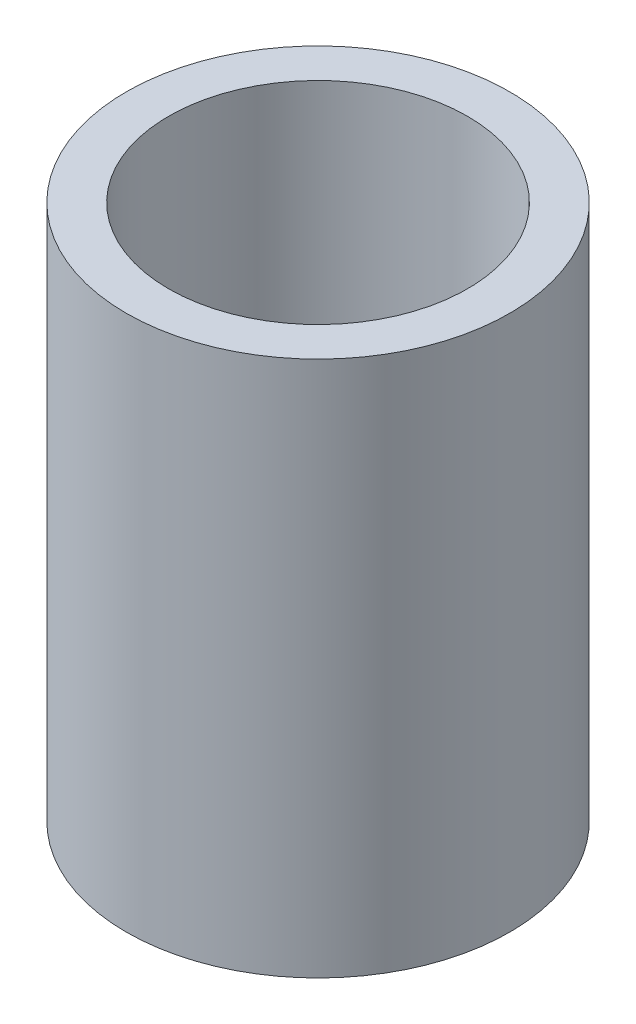
ISO-10303-21;
HEADER;
FILE_DESCRIPTION(('STEP AP214'),'2;1');
FILE_NAME('part.step','',(''),(''),'','','');
FILE_SCHEMA(('AUTOMOTIVE_DESIGN { 1 0 10303 214 1 1 1 1 }'));
ENDSEC;
DATA;
#1=APPLICATION_CONTEXT('core data for automotive mechanical design processes');
#2=APPLICATION_PROTOCOL_DEFINITION('international standard','automotive_design',2000,#1);
#3=PRODUCT_CONTEXT('',#1,'mechanical');
#4=PRODUCT('Part','Part','',(#3));
#5=PRODUCT_RELATED_PRODUCT_CATEGORY('part','',(#4));
#6=PRODUCT_DEFINITION_FORMATION('','',#4);
#7=PRODUCT_DEFINITION_CONTEXT('part definition',#1,'design');
#8=PRODUCT_DEFINITION('design','',#6,#7);
#9=PRODUCT_DEFINITION_SHAPE('','',#8);
#10=(LENGTH_UNIT() NAMED_UNIT(*) SI_UNIT(.MILLI.,.METRE.));
#11=(NAMED_UNIT(*) PLANE_ANGLE_UNIT() SI_UNIT($,.RADIAN.));
#12=(NAMED_UNIT(*) SI_UNIT($,.STERADIAN.) SOLID_ANGLE_UNIT());
#13=UNCERTAINTY_MEASURE_WITH_UNIT(LENGTH_MEASURE(1.E-05),#10,'distance_accuracy_value','');
#14=(GEOMETRIC_REPRESENTATION_CONTEXT(3) GLOBAL_UNCERTAINTY_ASSIGNED_CONTEXT((#13)) GLOBAL_UNIT_ASSIGNED_CONTEXT((#10,
#11,#12)) REPRESENTATION_CONTEXT('',''));
#15=CARTESIAN_POINT('',(0.,0.,0.));
#16=DIRECTION('',(0.,0.,1.));
#17=DIRECTION('',(1.,0.,0.));
#18=AXIS2_PLACEMENT_3D('',#15,#16,#17);
#19=CARTESIAN_POINT('',(0.,62.8765629511347,0.));
#20=DIRECTION('',(0.,-1.,0.));
#21=DIRECTION('',(0.,0.,-1.));
#22=AXIS2_PLACEMENT_3D('',#19,#20,#21);
#23=CYLINDRICAL_SURFACE('',#22,22.5);
#24=CARTESIAN_POINT('',(0.,62.8765629511347,0.));
#25=DIRECTION('',(0.,1.,0.));
#26=DIRECTION('',(0.,0.,1.));
#27=AXIS2_PLACEMENT_3D('',#24,#25,#26);
#28=CIRCLE('',#27,22.5);
#29=CARTESIAN_POINT('',(0.,62.8765629511347,22.5));
#30=VERTEX_POINT('',#29);
#31=EDGE_CURVE('E10',#30,#30,#28,.T.);
#32=ORIENTED_EDGE('',*,*,#31,.F.);
#33=EDGE_LOOP('',(#32));
#34=FACE_BOUND('',#33,.T.);
#35=CARTESIAN_POINT('',(0.,0.,0.));
#36=DIRECTION('',(0.,1.,0.));
#37=DIRECTION('',(0.,0.,1.));
#38=AXIS2_PLACEMENT_3D('',#35,#36,#37);
#39=CIRCLE('',#38,22.5);
#40=CARTESIAN_POINT('',(0.,0.,22.5));
#41=VERTEX_POINT('',#40);
#42=EDGE_CURVE('E37',#41,#41,#39,.T.);
#43=ORIENTED_EDGE('',*,*,#42,.T.);
#44=EDGE_LOOP('',(#43));
#45=FACE_BOUND('',#44,.T.);
#46=ADVANCED_FACE('F40',(#34,#45),#23,.T.);
#47=CARTESIAN_POINT('',(0.,62.8765629511347,0.));
#48=DIRECTION('',(0.,1.,0.));
#49=DIRECTION('',(0.,0.,1.));
#50=AXIS2_PLACEMENT_3D('',#47,#48,#49);
#51=PLANE('',#50);
#52=CARTESIAN_POINT('',(0.,62.8765629511347,0.));
#53=DIRECTION('',(0.,1.,0.));
#54=DIRECTION('',(0.,0.,1.));
#55=AXIS2_PLACEMENT_3D('',#52,#53,#54);
#56=CIRCLE('',#55,17.5354253428752);
#57=CARTESIAN_POINT('',(0.,62.8765629511347,17.5354253428752));
#58=VERTEX_POINT('',#57);
#59=EDGE_CURVE('E50',#58,#58,#56,.T.);
#60=ORIENTED_EDGE('',*,*,#59,.F.);
#61=EDGE_LOOP('',(#60));
#62=FACE_BOUND('',#61,.T.);
#63=ORIENTED_EDGE('',*,*,#31,.T.);
#64=EDGE_LOOP('',(#63));
#65=FACE_BOUND('',#64,.T.);
#66=ADVANCED_FACE('F59',(#62,#65),#51,.T.);
#67=CARTESIAN_POINT('',(0.,0.,0.));
#68=DIRECTION('',(0.,1.,0.));
#69=DIRECTION('',(0.,0.,1.));
#70=AXIS2_PLACEMENT_3D('',#67,#68,#69);
#71=PLANE('',#70);
#72=CARTESIAN_POINT('',(0.,0.,0.));
#73=DIRECTION('',(0.,1.,0.));
#74=DIRECTION('',(0.,0.,1.));
#75=AXIS2_PLACEMENT_3D('',#72,#73,#74);
#76=CIRCLE('',#75,17.5354253428752);
#77=CARTESIAN_POINT('',(0.,0.,17.5354253428752));
#78=VERTEX_POINT('',#77);
#79=EDGE_CURVE('E47',#78,#78,#76,.T.);
#80=ORIENTED_EDGE('',*,*,#79,.T.);
#81=EDGE_LOOP('',(#80));
#82=FACE_BOUND('',#81,.T.);
#83=ORIENTED_EDGE('',*,*,#42,.F.);
#84=EDGE_LOOP('',(#83));
#85=FACE_BOUND('',#84,.T.);
#86=ADVANCED_FACE('F58',(#82,#85),#71,.F.);
#87=CARTESIAN_POINT('',(0.,62.8765629511347,0.));
#88=DIRECTION('',(0.,-1.,0.));
#89=DIRECTION('',(0.,0.,-1.));
#90=AXIS2_PLACEMENT_3D('',#87,#88,#89);
#91=CYLINDRICAL_SURFACE('',#90,17.5354253428752);
#92=ORIENTED_EDGE('',*,*,#59,.T.);
#93=EDGE_LOOP('',(#92));
#94=FACE_BOUND('',#93,.T.);
#95=ORIENTED_EDGE('',*,*,#79,.F.);
#96=EDGE_LOOP('',(#95));
#97=FACE_BOUND('',#96,.T.);
#98=ADVANCED_FACE('F54',(#94,#97),#91,.F.);
#99=CLOSED_SHELL('',(#46,#66,#86,#98));
#100=MANIFOLD_SOLID_BREP('B2',#99);
#101=ADVANCED_BREP_SHAPE_REPRESENTATION('',(#18,#100),#14);
#102=SHAPE_DEFINITION_REPRESENTATION(#9,#101);
ENDSEC;
END-ISO-10303-21;
